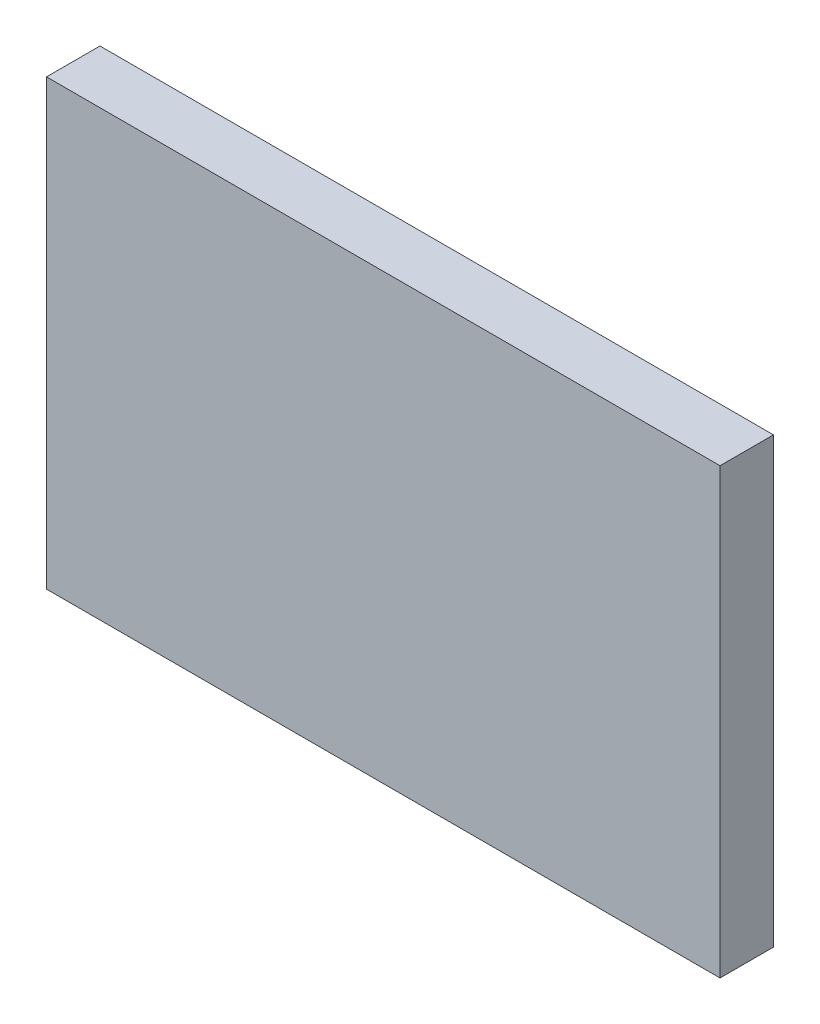
ISO-10303-21;
HEADER;
FILE_DESCRIPTION(('STEP AP214'),'2;1');
FILE_NAME('part.step','',(''),(''),'','','');
FILE_SCHEMA(('AUTOMOTIVE_DESIGN { 1 0 10303 214 1 1 1 1 }'));
ENDSEC;
DATA;
#1=APPLICATION_CONTEXT('core data for automotive mechanical design processes');
#2=APPLICATION_PROTOCOL_DEFINITION('international standard','automotive_design',2000,#1);
#3=PRODUCT_CONTEXT('',#1,'mechanical');
#4=PRODUCT('Part','Part','',(#3));
#5=PRODUCT_RELATED_PRODUCT_CATEGORY('part','',(#4));
#6=PRODUCT_DEFINITION_FORMATION('','',#4);
#7=PRODUCT_DEFINITION_CONTEXT('part definition',#1,'design');
#8=PRODUCT_DEFINITION('design','',#6,#7);
#9=PRODUCT_DEFINITION_SHAPE('','',#8);
#10=(LENGTH_UNIT() NAMED_UNIT(*) SI_UNIT(.MILLI.,.METRE.));
#11=(NAMED_UNIT(*) PLANE_ANGLE_UNIT() SI_UNIT($,.RADIAN.));
#12=(NAMED_UNIT(*) SI_UNIT($,.STERADIAN.) SOLID_ANGLE_UNIT());
#13=UNCERTAINTY_MEASURE_WITH_UNIT(LENGTH_MEASURE(1.E-05),#10,'distance_accuracy_value','');
#14=(GEOMETRIC_REPRESENTATION_CONTEXT(3) GLOBAL_UNCERTAINTY_ASSIGNED_CONTEXT((#13)) GLOBAL_UNIT_ASSIGNED_CONTEXT((#10,
#11,#12)) REPRESENTATION_CONTEXT('',''));
#15=CARTESIAN_POINT('',(0.,0.,0.));
#16=DIRECTION('',(0.,0.,1.));
#17=DIRECTION('',(1.,0.,0.));
#18=AXIS2_PLACEMENT_3D('',#15,#16,#17);
#19=CARTESIAN_POINT('',(0.,0.,1.));
#20=DIRECTION('',(1.,0.,0.));
#21=DIRECTION('',(0.,1.,0.));
#22=AXIS2_PLACEMENT_3D('',#19,#20,#21);
#23=PLANE('',#22);
#24=DIRECTION('',(0.,-1.,0.));
#25=VECTOR('',#24,1.);
#26=CARTESIAN_POINT('',(0.,0.,0.));
#27=LINE('',#26,#25);
#28=CARTESIAN_POINT('',(0.,0.,0.));
#29=VERTEX_POINT('',#28);
#30=CARTESIAN_POINT('',(0.,-8.3,0.));
#31=VERTEX_POINT('',#30);
#32=EDGE_CURVE('E75',#29,#31,#27,.T.);
#33=ORIENTED_EDGE('',*,*,#32,.T.);
#34=DIRECTION('',(0.,0.,-1.));
#35=VECTOR('',#34,1.);
#36=CARTESIAN_POINT('',(0.,-8.3,1.));
#37=LINE('',#36,#35);
#38=CARTESIAN_POINT('',(0.,-8.3,1.));
#39=VERTEX_POINT('',#38);
#40=EDGE_CURVE('E11',#39,#31,#37,.T.);
#41=ORIENTED_EDGE('',*,*,#40,.F.);
#42=DIRECTION('',(0.,-1.,0.));
#43=VECTOR('',#42,1.);
#44=CARTESIAN_POINT('',(0.,0.,1.));
#45=LINE('',#44,#43);
#46=CARTESIAN_POINT('',(0.,0.,1.));
#47=VERTEX_POINT('',#46);
#48=EDGE_CURVE('E93',#47,#39,#45,.T.);
#49=ORIENTED_EDGE('',*,*,#48,.F.);
#50=DIRECTION('',(0.,0.,-1.));
#51=VECTOR('',#50,1.);
#52=CARTESIAN_POINT('',(0.,0.,1.));
#53=LINE('',#52,#51);
#54=EDGE_CURVE('E87',#47,#29,#53,.T.);
#55=ORIENTED_EDGE('',*,*,#54,.T.);
#56=EDGE_LOOP('',(#33,#41,#49,#55));
#57=FACE_BOUND('',#56,.T.);
#58=ADVANCED_FACE('F31',(#57),#23,.F.);
#59=CARTESIAN_POINT('',(0.,-8.3,1.));
#60=DIRECTION('',(0.,1.,0.));
#61=DIRECTION('',(0.,0.,1.));
#62=AXIS2_PLACEMENT_3D('',#59,#60,#61);
#63=PLANE('',#62);
#64=DIRECTION('',(1.,0.,0.));
#65=VECTOR('',#64,1.);
#66=CARTESIAN_POINT('',(0.,-8.3,0.));
#67=LINE('',#66,#65);
#68=CARTESIAN_POINT('',(12.6,-8.3,0.));
#69=VERTEX_POINT('',#68);
#70=EDGE_CURVE('E71',#31,#69,#67,.T.);
#71=ORIENTED_EDGE('',*,*,#70,.T.);
#72=DIRECTION('',(0.,0.,-1.));
#73=VECTOR('',#72,1.);
#74=CARTESIAN_POINT('',(12.6,-8.3,1.));
#75=LINE('',#74,#73);
#76=CARTESIAN_POINT('',(12.6,-8.3,1.));
#77=VERTEX_POINT('',#76);
#78=EDGE_CURVE('E38',#77,#69,#75,.T.);
#79=ORIENTED_EDGE('',*,*,#78,.F.);
#80=DIRECTION('',(1.,0.,0.));
#81=VECTOR('',#80,1.);
#82=CARTESIAN_POINT('',(0.,-8.3,1.));
#83=LINE('',#82,#81);
#84=EDGE_CURVE('E83',#39,#77,#83,.T.);
#85=ORIENTED_EDGE('',*,*,#84,.F.);
#86=ORIENTED_EDGE('',*,*,#40,.T.);
#87=EDGE_LOOP('',(#71,#79,#85,#86));
#88=FACE_BOUND('',#87,.T.);
#89=ADVANCED_FACE('F82',(#88),#63,.F.);
#90=CARTESIAN_POINT('',(12.6,0.,1.));
#91=DIRECTION('',(-1.,0.,0.));
#92=DIRECTION('',(0.,-1.,0.));
#93=AXIS2_PLACEMENT_3D('',#90,#91,#92);
#94=PLANE('',#93);
#95=DIRECTION('',(0.,1.,0.));
#96=VECTOR('',#95,1.);
#97=CARTESIAN_POINT('',(12.6,0.,0.));
#98=LINE('',#97,#96);
#99=CARTESIAN_POINT('',(12.6,0.,0.));
#100=VERTEX_POINT('',#99);
#101=EDGE_CURVE('E76',#69,#100,#98,.T.);
#102=ORIENTED_EDGE('',*,*,#101,.T.);
#103=DIRECTION('',(0.,0.,-1.));
#104=VECTOR('',#103,1.);
#105=CARTESIAN_POINT('',(12.6,0.,1.));
#106=LINE('',#105,#104);
#107=CARTESIAN_POINT('',(12.6,0.,1.));
#108=VERTEX_POINT('',#107);
#109=EDGE_CURVE('E99',#108,#100,#106,.T.);
#110=ORIENTED_EDGE('',*,*,#109,.F.);
#111=DIRECTION('',(0.,1.,0.));
#112=VECTOR('',#111,1.);
#113=CARTESIAN_POINT('',(12.6,0.,1.));
#114=LINE('',#113,#112);
#115=EDGE_CURVE('E50',#77,#108,#114,.T.);
#116=ORIENTED_EDGE('',*,*,#115,.F.);
#117=ORIENTED_EDGE('',*,*,#78,.T.);
#118=EDGE_LOOP('',(#102,#110,#116,#117));
#119=FACE_BOUND('',#118,.T.);
#120=ADVANCED_FACE('F102',(#119),#94,.F.);
#121=CARTESIAN_POINT('',(0.,0.,1.));
#122=DIRECTION('',(0.,-1.,0.));
#123=DIRECTION('',(1.,0.,0.));
#124=AXIS2_PLACEMENT_3D('',#121,#122,#123);
#125=PLANE('',#124);
#126=DIRECTION('',(-1.,0.,0.));
#127=VECTOR('',#126,1.);
#128=CARTESIAN_POINT('',(0.,0.,0.));
#129=LINE('',#128,#127);
#130=EDGE_CURVE('E91',#100,#29,#129,.T.);
#131=ORIENTED_EDGE('',*,*,#130,.T.);
#132=ORIENTED_EDGE('',*,*,#54,.F.);
#133=DIRECTION('',(-1.,0.,0.));
#134=VECTOR('',#133,1.);
#135=CARTESIAN_POINT('',(0.,0.,1.));
#136=LINE('',#135,#134);
#137=EDGE_CURVE('E45',#108,#47,#136,.T.);
#138=ORIENTED_EDGE('',*,*,#137,.F.);
#139=ORIENTED_EDGE('',*,*,#109,.T.);
#140=EDGE_LOOP('',(#131,#132,#138,#139));
#141=FACE_BOUND('',#140,.T.);
#142=ADVANCED_FACE('F104',(#141),#125,.F.);
#143=CARTESIAN_POINT('',(0.,-8.3,1.));
#144=DIRECTION('',(0.,0.,1.));
#145=DIRECTION('',(1.,0.,0.));
#146=AXIS2_PLACEMENT_3D('',#143,#144,#145);
#147=PLANE('',#146);
#148=ORIENTED_EDGE('',*,*,#48,.T.);
#149=ORIENTED_EDGE('',*,*,#84,.T.);
#150=ORIENTED_EDGE('',*,*,#115,.T.);
#151=ORIENTED_EDGE('',*,*,#137,.T.);
#152=EDGE_LOOP('',(#148,#149,#150,#151));
#153=FACE_BOUND('',#152,.T.);
#154=ADVANCED_FACE('F105',(#153),#147,.T.);
#155=CARTESIAN_POINT('',(0.,-8.3,0.));
#156=DIRECTION('',(0.,0.,1.));
#157=DIRECTION('',(1.,0.,0.));
#158=AXIS2_PLACEMENT_3D('',#155,#156,#157);
#159=PLANE('',#158);
#160=ORIENTED_EDGE('',*,*,#32,.F.);
#161=ORIENTED_EDGE('',*,*,#130,.F.);
#162=ORIENTED_EDGE('',*,*,#101,.F.);
#163=ORIENTED_EDGE('',*,*,#70,.F.);
#164=EDGE_LOOP('',(#160,#161,#162,#163));
#165=FACE_BOUND('',#164,.T.);
#166=ADVANCED_FACE('F72',(#165),#159,.F.);
#167=CLOSED_SHELL('',(#58,#89,#120,#142,#154,#166));
#168=MANIFOLD_SOLID_BREP('B2',#167);
#169=ADVANCED_BREP_SHAPE_REPRESENTATION('',(#18,#168),#14);
#170=SHAPE_DEFINITION_REPRESENTATION(#9,#169);
ENDSEC;
END-ISO-10303-21;
